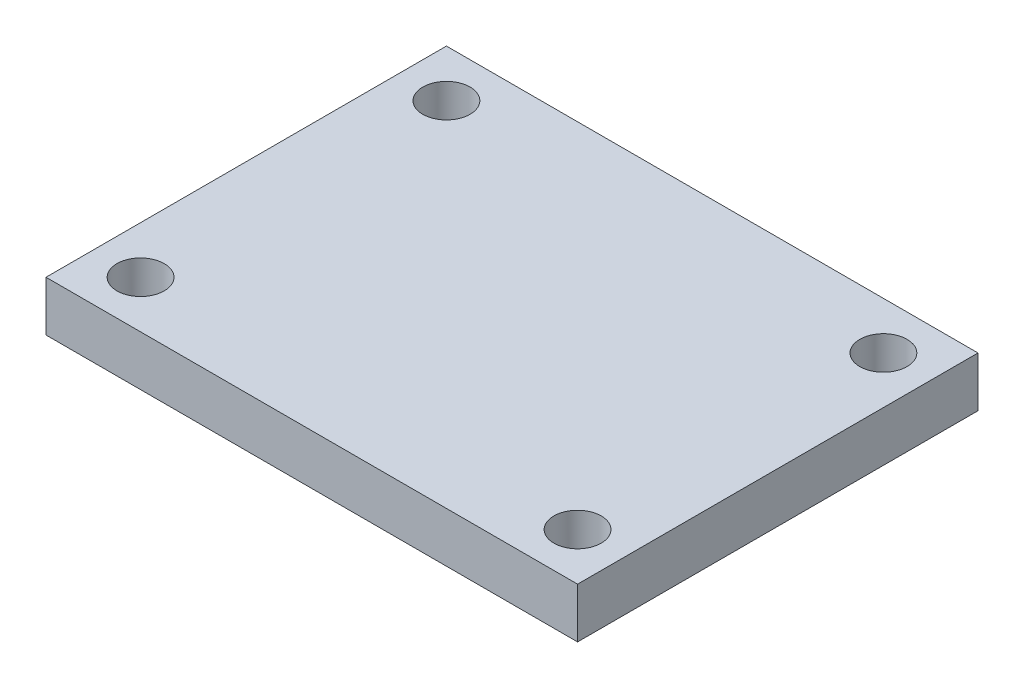
ISO-10303-21;
HEADER;
FILE_DESCRIPTION(('STEP AP214'),'2;1');
FILE_NAME('part.step','',(''),(''),'','','');
FILE_SCHEMA(('AUTOMOTIVE_DESIGN { 1 0 10303 214 1 1 1 1 }'));
ENDSEC;
DATA;
#1=APPLICATION_CONTEXT('core data for automotive mechanical design processes');
#2=APPLICATION_PROTOCOL_DEFINITION('international standard','automotive_design',2000,#1);
#3=PRODUCT_CONTEXT('',#1,'mechanical');
#4=PRODUCT('Part','Part','',(#3));
#5=PRODUCT_RELATED_PRODUCT_CATEGORY('part','',(#4));
#6=PRODUCT_DEFINITION_FORMATION('','',#4);
#7=PRODUCT_DEFINITION_CONTEXT('part definition',#1,'design');
#8=PRODUCT_DEFINITION('design','',#6,#7);
#9=PRODUCT_DEFINITION_SHAPE('','',#8);
#10=(LENGTH_UNIT() NAMED_UNIT(*) SI_UNIT(.MILLI.,.METRE.));
#11=(NAMED_UNIT(*) PLANE_ANGLE_UNIT() SI_UNIT($,.RADIAN.));
#12=(NAMED_UNIT(*) SI_UNIT($,.STERADIAN.) SOLID_ANGLE_UNIT());
#13=UNCERTAINTY_MEASURE_WITH_UNIT(LENGTH_MEASURE(1.E-05),#10,'distance_accuracy_value','');
#14=(GEOMETRIC_REPRESENTATION_CONTEXT(3) GLOBAL_UNCERTAINTY_ASSIGNED_CONTEXT((#13)) GLOBAL_UNIT_ASSIGNED_CONTEXT((#10,
#11,#12)) REPRESENTATION_CONTEXT('',''));
#15=CARTESIAN_POINT('',(0.,0.,0.));
#16=DIRECTION('',(0.,0.,1.));
#17=DIRECTION('',(1.,0.,0.));
#18=AXIS2_PLACEMENT_3D('',#15,#16,#17);
#19=CARTESIAN_POINT('',(-16.85925,3.175,12.7));
#20=DIRECTION('',(1.,0.,0.));
#21=DIRECTION('',(0.,0.,-1.));
#22=AXIS2_PLACEMENT_3D('',#19,#20,#21);
#23=PLANE('',#22);
#24=DIRECTION('',(0.,0.,1.));
#25=VECTOR('',#24,1.);
#26=CARTESIAN_POINT('',(-16.85925,0.,12.7));
#27=LINE('',#26,#25);
#28=CARTESIAN_POINT('',(-16.85925,0.,-12.7));
#29=VERTEX_POINT('',#28);
#30=CARTESIAN_POINT('',(-16.85925,0.,12.7));
#31=VERTEX_POINT('',#30);
#32=EDGE_CURVE('E116',#29,#31,#27,.T.);
#33=ORIENTED_EDGE('',*,*,#32,.T.);
#34=DIRECTION('',(0.,-1.,0.));
#35=VECTOR('',#34,1.);
#36=CARTESIAN_POINT('',(-16.85925,3.175,12.7));
#37=LINE('',#36,#35);
#38=CARTESIAN_POINT('',(-16.85925,3.175,12.7));
#39=VERTEX_POINT('',#38);
#40=EDGE_CURVE('E11',#39,#31,#37,.T.);
#41=ORIENTED_EDGE('',*,*,#40,.F.);
#42=DIRECTION('',(0.,0.,1.));
#43=VECTOR('',#42,1.);
#44=CARTESIAN_POINT('',(-16.85925,3.175,12.7));
#45=LINE('',#44,#43);
#46=CARTESIAN_POINT('',(-16.85925,3.175,-12.7));
#47=VERTEX_POINT('',#46);
#48=EDGE_CURVE('E98',#47,#39,#45,.T.);
#49=ORIENTED_EDGE('',*,*,#48,.F.);
#50=DIRECTION('',(0.,-1.,0.));
#51=VECTOR('',#50,1.);
#52=CARTESIAN_POINT('',(-16.85925,3.175,-12.7));
#53=LINE('',#52,#51);
#54=EDGE_CURVE('E112',#47,#29,#53,.T.);
#55=ORIENTED_EDGE('',*,*,#54,.T.);
#56=EDGE_LOOP('',(#33,#41,#49,#55));
#57=FACE_BOUND('',#56,.T.);
#58=ADVANCED_FACE('F44',(#57),#23,.F.);
#59=CARTESIAN_POINT('',(16.85925,3.175,12.7));
#60=DIRECTION('',(0.,0.,-1.));
#61=DIRECTION('',(-1.,0.,0.));
#62=AXIS2_PLACEMENT_3D('',#59,#60,#61);
#63=PLANE('',#62);
#64=DIRECTION('',(1.,0.,0.));
#65=VECTOR('',#64,1.);
#66=CARTESIAN_POINT('',(16.85925,0.,12.7));
#67=LINE('',#66,#65);
#68=CARTESIAN_POINT('',(16.85925,0.,12.7));
#69=VERTEX_POINT('',#68);
#70=EDGE_CURVE('E103',#31,#69,#67,.T.);
#71=ORIENTED_EDGE('',*,*,#70,.T.);
#72=DIRECTION('',(0.,-1.,0.));
#73=VECTOR('',#72,1.);
#74=CARTESIAN_POINT('',(16.85925,3.175,12.7));
#75=LINE('',#74,#73);
#76=CARTESIAN_POINT('',(16.85925,3.175,12.7));
#77=VERTEX_POINT('',#76);
#78=EDGE_CURVE('E54',#77,#69,#75,.T.);
#79=ORIENTED_EDGE('',*,*,#78,.F.);
#80=DIRECTION('',(1.,0.,0.));
#81=VECTOR('',#80,1.);
#82=CARTESIAN_POINT('',(16.85925,3.175,12.7));
#83=LINE('',#82,#81);
#84=EDGE_CURVE('E93',#39,#77,#83,.T.);
#85=ORIENTED_EDGE('',*,*,#84,.F.);
#86=ORIENTED_EDGE('',*,*,#40,.T.);
#87=EDGE_LOOP('',(#71,#79,#85,#86));
#88=FACE_BOUND('',#87,.T.);
#89=ADVANCED_FACE('F102',(#88),#63,.F.);
#90=CARTESIAN_POINT('',(16.85925,3.175,12.7));
#91=DIRECTION('',(-1.,0.,0.));
#92=DIRECTION('',(0.,0.,1.));
#93=AXIS2_PLACEMENT_3D('',#90,#91,#92);
#94=PLANE('',#93);
#95=DIRECTION('',(0.,0.,-1.));
#96=VECTOR('',#95,1.);
#97=CARTESIAN_POINT('',(16.85925,0.,12.7));
#98=LINE('',#97,#96);
#99=CARTESIAN_POINT('',(16.85925,0.,-12.7));
#100=VERTEX_POINT('',#99);
#101=EDGE_CURVE('E80',#69,#100,#98,.T.);
#102=ORIENTED_EDGE('',*,*,#101,.T.);
#103=DIRECTION('',(0.,-1.,0.));
#104=VECTOR('',#103,1.);
#105=CARTESIAN_POINT('',(16.85925,3.175,-12.7));
#106=LINE('',#105,#104);
#107=CARTESIAN_POINT('',(16.85925,3.175,-12.7));
#108=VERTEX_POINT('',#107);
#109=EDGE_CURVE('E105',#108,#100,#106,.T.);
#110=ORIENTED_EDGE('',*,*,#109,.F.);
#111=DIRECTION('',(0.,0.,-1.));
#112=VECTOR('',#111,1.);
#113=CARTESIAN_POINT('',(16.85925,3.175,12.7));
#114=LINE('',#113,#112);
#115=EDGE_CURVE('E96',#77,#108,#114,.T.);
#116=ORIENTED_EDGE('',*,*,#115,.F.);
#117=ORIENTED_EDGE('',*,*,#78,.T.);
#118=EDGE_LOOP('',(#102,#110,#116,#117));
#119=FACE_BOUND('',#118,.T.);
#120=ADVANCED_FACE('F107',(#119),#94,.F.);
#121=CARTESIAN_POINT('',(16.85925,3.175,-12.7));
#122=DIRECTION('',(0.,0.,1.));
#123=DIRECTION('',(1.,0.,0.));
#124=AXIS2_PLACEMENT_3D('',#121,#122,#123);
#125=PLANE('',#124);
#126=DIRECTION('',(-1.,0.,0.));
#127=VECTOR('',#126,1.);
#128=CARTESIAN_POINT('',(16.85925,0.,-12.7));
#129=LINE('',#128,#127);
#130=EDGE_CURVE('E86',#100,#29,#129,.T.);
#131=ORIENTED_EDGE('',*,*,#130,.T.);
#132=ORIENTED_EDGE('',*,*,#54,.F.);
#133=DIRECTION('',(-1.,0.,0.));
#134=VECTOR('',#133,1.);
#135=CARTESIAN_POINT('',(16.85925,3.175,-12.7));
#136=LINE('',#135,#134);
#137=EDGE_CURVE('E63',#108,#47,#136,.T.);
#138=ORIENTED_EDGE('',*,*,#137,.F.);
#139=ORIENTED_EDGE('',*,*,#109,.T.);
#140=EDGE_LOOP('',(#131,#132,#138,#139));
#141=FACE_BOUND('',#140,.T.);
#142=ADVANCED_FACE('F180',(#141),#125,.F.);
#143=CARTESIAN_POINT('',(0.,3.175,0.));
#144=DIRECTION('',(0.,1.,0.));
#145=DIRECTION('',(0.,0.,1.));
#146=AXIS2_PLACEMENT_3D('',#143,#144,#145);
#147=PLANE('',#146);
#148=CARTESIAN_POINT('',(13.85925,3.175,-9.7));
#149=DIRECTION('',(0.,1.,0.));
#150=DIRECTION('',(0.,0.,1.));
#151=AXIS2_PLACEMENT_3D('',#148,#149,#150);
#152=CIRCLE('',#151,1.5);
#153=CARTESIAN_POINT('',(13.85925,3.175,-8.2));
#154=VERTEX_POINT('',#153);
#155=EDGE_CURVE('E279',#154,#154,#152,.T.);
#156=ORIENTED_EDGE('',*,*,#155,.F.);
#157=EDGE_LOOP('',(#156));
#158=FACE_BOUND('',#157,.T.);
#159=CARTESIAN_POINT('',(13.85925,3.175,9.7));
#160=DIRECTION('',(0.,1.,0.));
#161=DIRECTION('',(0.,0.,-1.));
#162=AXIS2_PLACEMENT_3D('',#159,#160,#161);
#163=CIRCLE('',#162,1.5);
#164=CARTESIAN_POINT('',(13.85925,3.175,8.2));
#165=VERTEX_POINT('',#164);
#166=EDGE_CURVE('E274',#165,#165,#163,.T.);
#167=ORIENTED_EDGE('',*,*,#166,.F.);
#168=EDGE_LOOP('',(#167));
#169=FACE_BOUND('',#168,.T.);
#170=CARTESIAN_POINT('',(-13.85925,3.175,9.7));
#171=DIRECTION('',(0.,1.,0.));
#172=DIRECTION('',(0.,0.,-1.));
#173=AXIS2_PLACEMENT_3D('',#170,#171,#172);
#174=CIRCLE('',#173,1.5);
#175=CARTESIAN_POINT('',(-13.85925,3.175,8.2));
#176=VERTEX_POINT('',#175);
#177=EDGE_CURVE('E266',#176,#176,#174,.T.);
#178=ORIENTED_EDGE('',*,*,#177,.F.);
#179=EDGE_LOOP('',(#178));
#180=FACE_BOUND('',#179,.T.);
#181=CARTESIAN_POINT('',(-13.85925,3.175,-9.7));
#182=DIRECTION('',(0.,1.,0.));
#183=DIRECTION('',(0.,0.,1.));
#184=AXIS2_PLACEMENT_3D('',#181,#182,#183);
#185=CIRCLE('',#184,1.5);
#186=CARTESIAN_POINT('',(-13.85925,3.175,-8.2));
#187=VERTEX_POINT('',#186);
#188=EDGE_CURVE('E135',#187,#187,#185,.T.);
#189=ORIENTED_EDGE('',*,*,#188,.F.);
#190=EDGE_LOOP('',(#189));
#191=FACE_BOUND('',#190,.T.);
#192=ORIENTED_EDGE('',*,*,#48,.T.);
#193=ORIENTED_EDGE('',*,*,#84,.T.);
#194=ORIENTED_EDGE('',*,*,#115,.T.);
#195=ORIENTED_EDGE('',*,*,#137,.T.);
#196=EDGE_LOOP('',(#192,#193,#194,#195));
#197=FACE_BOUND('',#196,.T.);
#198=ADVANCED_FACE('F94',(#158,#169,#180,#191,#197),#147,.T.);
#199=CARTESIAN_POINT('',(0.,0.,0.));
#200=DIRECTION('',(0.,1.,0.));
#201=DIRECTION('',(0.,0.,1.));
#202=AXIS2_PLACEMENT_3D('',#199,#200,#201);
#203=PLANE('',#202);
#204=CARTESIAN_POINT('',(13.85925,0.,-9.7));
#205=DIRECTION('',(0.,1.,0.));
#206=DIRECTION('',(0.,0.,1.));
#207=AXIS2_PLACEMENT_3D('',#204,#205,#206);
#208=CIRCLE('',#207,1.5);
#209=CARTESIAN_POINT('',(13.85925,0.,-8.2));
#210=VERTEX_POINT('',#209);
#211=EDGE_CURVE('E47',#210,#210,#208,.T.);
#212=ORIENTED_EDGE('',*,*,#211,.T.);
#213=EDGE_LOOP('',(#212));
#214=FACE_BOUND('',#213,.T.);
#215=CARTESIAN_POINT('',(13.85925,0.,9.7));
#216=DIRECTION('',(0.,1.,0.));
#217=DIRECTION('',(0.,0.,1.));
#218=AXIS2_PLACEMENT_3D('',#215,#216,#217);
#219=CIRCLE('',#218,1.5);
#220=CARTESIAN_POINT('',(13.85925,0.,11.2));
#221=VERTEX_POINT('',#220);
#222=EDGE_CURVE('E138',#221,#221,#219,.T.);
#223=ORIENTED_EDGE('',*,*,#222,.T.);
#224=EDGE_LOOP('',(#223));
#225=FACE_BOUND('',#224,.T.);
#226=CARTESIAN_POINT('',(-13.85925,0.,9.7));
#227=DIRECTION('',(0.,1.,0.));
#228=DIRECTION('',(0.,0.,1.));
#229=AXIS2_PLACEMENT_3D('',#226,#227,#228);
#230=CIRCLE('',#229,1.5);
#231=CARTESIAN_POINT('',(-13.85925,0.,11.2));
#232=VERTEX_POINT('',#231);
#233=EDGE_CURVE('E134',#232,#232,#230,.T.);
#234=ORIENTED_EDGE('',*,*,#233,.T.);
#235=EDGE_LOOP('',(#234));
#236=FACE_BOUND('',#235,.T.);
#237=CARTESIAN_POINT('',(-13.85925,0.,-9.7));
#238=DIRECTION('',(0.,1.,0.));
#239=DIRECTION('',(0.,0.,1.));
#240=AXIS2_PLACEMENT_3D('',#237,#238,#239);
#241=CIRCLE('',#240,1.5);
#242=CARTESIAN_POINT('',(-13.85925,0.,-8.2));
#243=VERTEX_POINT('',#242);
#244=EDGE_CURVE('E130',#243,#243,#241,.T.);
#245=ORIENTED_EDGE('',*,*,#244,.T.);
#246=EDGE_LOOP('',(#245));
#247=FACE_BOUND('',#246,.T.);
#248=ORIENTED_EDGE('',*,*,#32,.F.);
#249=ORIENTED_EDGE('',*,*,#130,.F.);
#250=ORIENTED_EDGE('',*,*,#101,.F.);
#251=ORIENTED_EDGE('',*,*,#70,.F.);
#252=EDGE_LOOP('',(#248,#249,#250,#251));
#253=FACE_BOUND('',#252,.T.);
#254=ADVANCED_FACE('F149',(#214,#225,#236,#247,#253),#203,.F.);
#255=CARTESIAN_POINT('',(-13.85925,-6.825,-9.7));
#256=DIRECTION('',(0.,1.,0.));
#257=DIRECTION('',(0.,0.,1.));
#258=AXIS2_PLACEMENT_3D('',#255,#256,#257);
#259=CYLINDRICAL_SURFACE('',#258,1.5);
#260=ORIENTED_EDGE('',*,*,#188,.T.);
#261=EDGE_LOOP('',(#260));
#262=FACE_BOUND('',#261,.T.);
#263=ORIENTED_EDGE('',*,*,#244,.F.);
#264=EDGE_LOOP('',(#263));
#265=FACE_BOUND('',#264,.T.);
#266=ADVANCED_FACE('F172',(#262,#265),#259,.F.);
#267=CARTESIAN_POINT('',(-13.85925,-6.825,9.7));
#268=DIRECTION('',(0.,1.,0.));
#269=DIRECTION('',(0.,0.,1.));
#270=AXIS2_PLACEMENT_3D('',#267,#268,#269);
#271=CYLINDRICAL_SURFACE('',#270,1.5);
#272=ORIENTED_EDGE('',*,*,#177,.T.);
#273=EDGE_LOOP('',(#272));
#274=FACE_BOUND('',#273,.T.);
#275=ORIENTED_EDGE('',*,*,#233,.F.);
#276=EDGE_LOOP('',(#275));
#277=FACE_BOUND('',#276,.T.);
#278=ADVANCED_FACE('F159',(#274,#277),#271,.F.);
#279=CARTESIAN_POINT('',(13.85925,-6.825,9.7));
#280=DIRECTION('',(0.,1.,0.));
#281=DIRECTION('',(0.,0.,1.));
#282=AXIS2_PLACEMENT_3D('',#279,#280,#281);
#283=CYLINDRICAL_SURFACE('',#282,1.5);
#284=ORIENTED_EDGE('',*,*,#166,.T.);
#285=EDGE_LOOP('',(#284));
#286=FACE_BOUND('',#285,.T.);
#287=ORIENTED_EDGE('',*,*,#222,.F.);
#288=EDGE_LOOP('',(#287));
#289=FACE_BOUND('',#288,.T.);
#290=ADVANCED_FACE('F153',(#286,#289),#283,.F.);
#291=CARTESIAN_POINT('',(13.85925,-6.825,-9.7));
#292=DIRECTION('',(0.,1.,0.));
#293=DIRECTION('',(0.,0.,1.));
#294=AXIS2_PLACEMENT_3D('',#291,#292,#293);
#295=CYLINDRICAL_SURFACE('',#294,1.5);
#296=ORIENTED_EDGE('',*,*,#155,.T.);
#297=EDGE_LOOP('',(#296));
#298=FACE_BOUND('',#297,.T.);
#299=ORIENTED_EDGE('',*,*,#211,.F.);
#300=EDGE_LOOP('',(#299));
#301=FACE_BOUND('',#300,.T.);
#302=ADVANCED_FACE('F151',(#298,#301),#295,.F.);
#303=CLOSED_SHELL('',(#58,#89,#120,#142,#198,#254,#266,#278,#290,#302));
#304=MANIFOLD_SOLID_BREP('B2',#303);
#305=ADVANCED_BREP_SHAPE_REPRESENTATION('',(#18,#304),#14);
#306=SHAPE_DEFINITION_REPRESENTATION(#9,#305);
ENDSEC;
END-ISO-10303-21;
